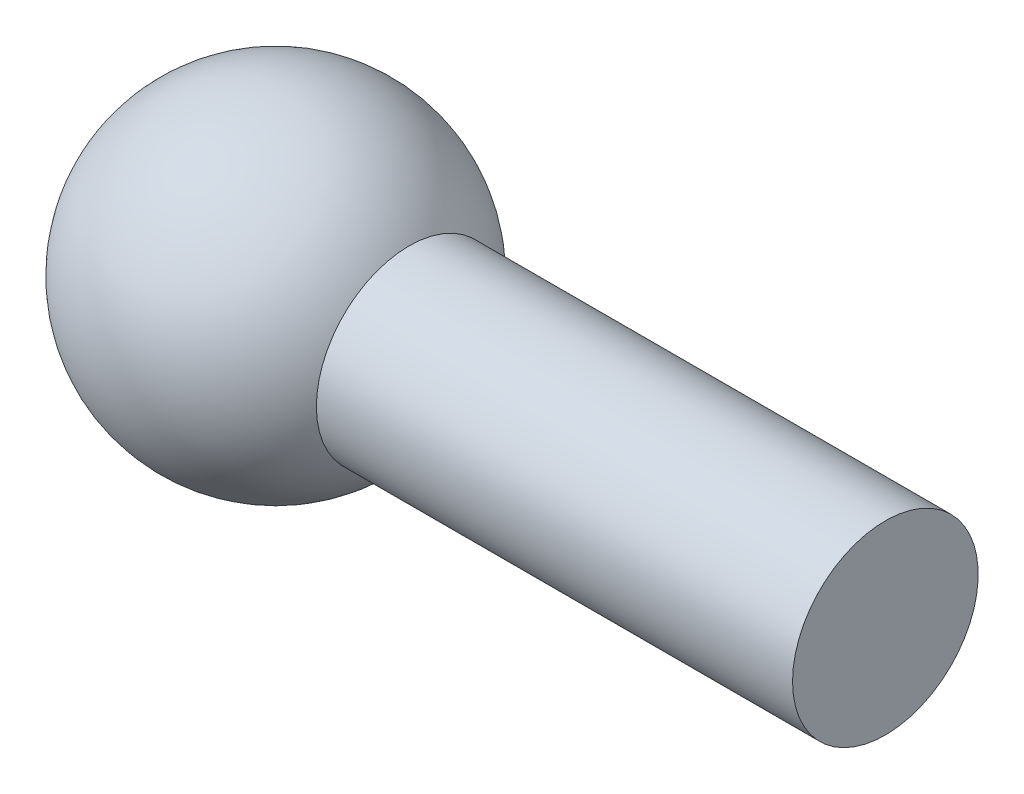
ISO-10303-21;
HEADER;
FILE_DESCRIPTION(('STEP AP214'),'2;1');
FILE_NAME('part.step','',(''),(''),'','','');
FILE_SCHEMA(('AUTOMOTIVE_DESIGN { 1 0 10303 214 1 1 1 1 }'));
ENDSEC;
DATA;
#1=APPLICATION_CONTEXT('core data for automotive mechanical design processes');
#2=APPLICATION_PROTOCOL_DEFINITION('international standard','automotive_design',2000,#1);
#3=PRODUCT_CONTEXT('',#1,'mechanical');
#4=PRODUCT('Part','Part','',(#3));
#5=PRODUCT_RELATED_PRODUCT_CATEGORY('part','',(#4));
#6=PRODUCT_DEFINITION_FORMATION('','',#4);
#7=PRODUCT_DEFINITION_CONTEXT('part definition',#1,'design');
#8=PRODUCT_DEFINITION('design','',#6,#7);
#9=PRODUCT_DEFINITION_SHAPE('','',#8);
#10=(LENGTH_UNIT() NAMED_UNIT(*) SI_UNIT(.MILLI.,.METRE.));
#11=(NAMED_UNIT(*) PLANE_ANGLE_UNIT() SI_UNIT($,.RADIAN.));
#12=(NAMED_UNIT(*) SI_UNIT($,.STERADIAN.) SOLID_ANGLE_UNIT());
#13=UNCERTAINTY_MEASURE_WITH_UNIT(LENGTH_MEASURE(1.E-05),#10,'distance_accuracy_value','');
#14=(GEOMETRIC_REPRESENTATION_CONTEXT(3) GLOBAL_UNCERTAINTY_ASSIGNED_CONTEXT((#13)) GLOBAL_UNIT_ASSIGNED_CONTEXT((#10,
#11,#12)) REPRESENTATION_CONTEXT('',''));
#15=CARTESIAN_POINT('',(0.,0.,0.));
#16=DIRECTION('',(0.,0.,1.));
#17=DIRECTION('',(1.,0.,0.));
#18=AXIS2_PLACEMENT_3D('',#15,#16,#17);
#19=CARTESIAN_POINT('',(15.,0.,0.));
#20=DIRECTION('',(-1.,0.,0.));
#21=DIRECTION('',(0.,0.,1.));
#22=AXIS2_PLACEMENT_3D('',#19,#20,#21);
#23=CYLINDRICAL_SURFACE('',#22,11.4175731632544);
#24=CARTESIAN_POINT('',(75.,0.,0.));
#25=DIRECTION('',(-1.,0.,0.));
#26=DIRECTION('',(0.,0.,1.));
#27=AXIS2_PLACEMENT_3D('',#24,#25,#26);
#28=CIRCLE('',#27,11.4175731632544);
#29=CARTESIAN_POINT('',(75.,0.,11.4175731632544));
#30=VERTEX_POINT('',#29);
#31=EDGE_CURVE('E53',#30,#30,#28,.T.);
#32=ORIENTED_EDGE('',*,*,#31,.T.);
#33=EDGE_LOOP('',(#32));
#34=FACE_BOUND('',#33,.T.);
#35=CARTESIAN_POINT('',(16.420688872935,0.,0.));
#36=DIRECTION('',(-1.,0.,0.));
#37=DIRECTION('',(0.,0.,1.));
#38=AXIS2_PLACEMENT_3D('',#35,#36,#37);
#39=CIRCLE('',#38,11.4175731632544);
#40=CARTESIAN_POINT('',(16.420688872935,0.,11.4175731632544));
#41=VERTEX_POINT('',#40);
#42=EDGE_CURVE('E10',#41,#41,#39,.T.);
#43=ORIENTED_EDGE('',*,*,#42,.F.);
#44=EDGE_LOOP('',(#43));
#45=FACE_BOUND('',#44,.T.);
#46=ADVANCED_FACE('F44',(#34,#45),#23,.T.);
#47=CARTESIAN_POINT('',(75.,11.4175731632544,0.));
#48=DIRECTION('',(1.,0.,0.));
#49=DIRECTION('',(0.,0.,-1.));
#50=AXIS2_PLACEMENT_3D('',#47,#48,#49);
#51=PLANE('',#50);
#52=ORIENTED_EDGE('',*,*,#31,.F.);
#53=EDGE_LOOP('',(#52));
#54=FACE_BOUND('',#53,.T.);
#55=ADVANCED_FACE('F96',(#54),#51,.T.);
#56=CARTESIAN_POINT('',(0.,0.,0.));
#57=DIRECTION('',(-1.,0.,0.));
#58=DIRECTION('',(0.,1.,0.));
#59=AXIS2_PLACEMENT_3D('',#56,#57,#58);
#60=SPHERICAL_SURFACE('',#59,20.);
#61=ORIENTED_EDGE('',*,*,#42,.T.);
#62=EDGE_LOOP('',(#61));
#63=FACE_BOUND('',#62,.T.);
#64=ADVANCED_FACE('F46',(#63),#60,.T.);
#65=CLOSED_SHELL('',(#46,#55,#64));
#66=CARTESIAN_POINT('',(0.,0.,0.));
#67=DIRECTION('',(-1.,0.,0.));
#68=DIRECTION('',(0.,1.,0.));
#69=AXIS2_PLACEMENT_3D('',#66,#67,#68);
#70=SPHERICAL_SURFACE('',#69,10.);
#71=CARTESIAN_POINT('',(-10.,0.,0.));
#72=VERTEX_POINT('',#71);
#73=VERTEX_LOOP('',#72);
#74=FACE_BOUND('',#73,.T.);
#75=ADVANCED_FACE('F90',(#74),#70,.F.);
#76=CLOSED_SHELL('',(#75));
#77=CARTESIAN_POINT('',(65.,11.4175731632544,0.));
#78=DIRECTION('',(1.,0.,0.));
#79=DIRECTION('',(0.,0.,-1.));
#80=AXIS2_PLACEMENT_3D('',#77,#78,#79);
#81=PLANE('',#80);
#82=CARTESIAN_POINT('',(65.,0.,0.));
#83=DIRECTION('',(-1.,0.,0.));
#84=DIRECTION('',(0.,0.,1.));
#85=AXIS2_PLACEMENT_3D('',#82,#83,#84);
#86=CIRCLE('',#85,1.41757316325442);
#87=CARTESIAN_POINT('',(65.,0.,1.41757316325442));
#88=VERTEX_POINT('',#87);
#89=EDGE_CURVE('E63',#88,#88,#86,.T.);
#90=ORIENTED_EDGE('',*,*,#89,.T.);
#91=EDGE_LOOP('',(#90));
#92=FACE_BOUND('',#91,.T.);
#93=ADVANCED_FACE('F70',(#92),#81,.F.);
#94=CARTESIAN_POINT('',(25.,0.,0.));
#95=DIRECTION('',(-1.,0.,0.));
#96=DIRECTION('',(0.,0.,1.));
#97=AXIS2_PLACEMENT_3D('',#94,#95,#96);
#98=PLANE('',#97);
#99=CARTESIAN_POINT('',(25.,0.,0.));
#100=DIRECTION('',(-1.,0.,0.));
#101=DIRECTION('',(0.,0.,1.));
#102=AXIS2_PLACEMENT_3D('',#99,#100,#101);
#103=CIRCLE('',#102,1.41757316325442);
#104=CARTESIAN_POINT('',(25.,0.,1.41757316325442));
#105=VERTEX_POINT('',#104);
#106=EDGE_CURVE('E58',#105,#105,#103,.T.);
#107=ORIENTED_EDGE('',*,*,#106,.F.);
#108=EDGE_LOOP('',(#107));
#109=FACE_BOUND('',#108,.T.);
#110=ADVANCED_FACE('F75',(#109),#98,.F.);
#111=CARTESIAN_POINT('',(15.,0.,0.));
#112=DIRECTION('',(-1.,0.,0.));
#113=DIRECTION('',(0.,0.,1.));
#114=AXIS2_PLACEMENT_3D('',#111,#112,#113);
#115=CYLINDRICAL_SURFACE('',#114,1.41757316325442);
#116=ORIENTED_EDGE('',*,*,#89,.F.);
#117=EDGE_LOOP('',(#116));
#118=FACE_BOUND('',#117,.T.);
#119=ORIENTED_EDGE('',*,*,#106,.T.);
#120=EDGE_LOOP('',(#119));
#121=FACE_BOUND('',#120,.T.);
#122=ADVANCED_FACE('F72',(#118,#121),#115,.F.);
#123=CLOSED_SHELL('',(#93,#110,#122));
#124=ORIENTED_CLOSED_SHELL('',*,#76,.T.);
#125=ORIENTED_CLOSED_SHELL('',*,#123,.T.);
#126=BREP_WITH_VOIDS('B2',#65,(#124,#125));
#127=ADVANCED_BREP_SHAPE_REPRESENTATION('',(#18,#126),#14);
#128=SHAPE_DEFINITION_REPRESENTATION(#9,#127);
ENDSEC;
END-ISO-10303-21;
